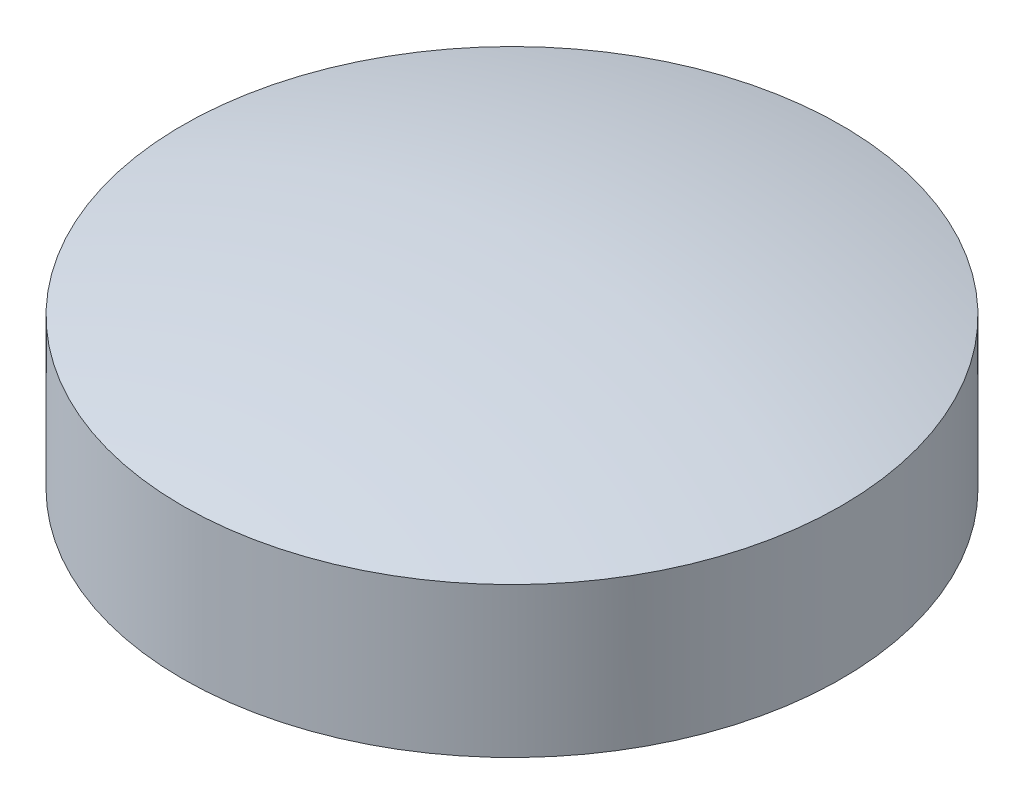
ISO-10303-21;
HEADER;
FILE_DESCRIPTION(('STEP AP214'),'2;1');
FILE_NAME('part.step','',(''),(''),'','','');
FILE_SCHEMA(('AUTOMOTIVE_DESIGN { 1 0 10303 214 1 1 1 1 }'));
ENDSEC;
DATA;
#1=APPLICATION_CONTEXT('core data for automotive mechanical design processes');
#2=APPLICATION_PROTOCOL_DEFINITION('international standard','automotive_design',2000,#1);
#3=PRODUCT_CONTEXT('',#1,'mechanical');
#4=PRODUCT('Part','Part','',(#3));
#5=PRODUCT_RELATED_PRODUCT_CATEGORY('part','',(#4));
#6=PRODUCT_DEFINITION_FORMATION('','',#4);
#7=PRODUCT_DEFINITION_CONTEXT('part definition',#1,'design');
#8=PRODUCT_DEFINITION('design','',#6,#7);
#9=PRODUCT_DEFINITION_SHAPE('','',#8);
#10=(LENGTH_UNIT() NAMED_UNIT(*) SI_UNIT(.MILLI.,.METRE.));
#11=(NAMED_UNIT(*) PLANE_ANGLE_UNIT() SI_UNIT($,.RADIAN.));
#12=(NAMED_UNIT(*) SI_UNIT($,.STERADIAN.) SOLID_ANGLE_UNIT());
#13=UNCERTAINTY_MEASURE_WITH_UNIT(LENGTH_MEASURE(1.E-05),#10,'distance_accuracy_value','');
#14=(GEOMETRIC_REPRESENTATION_CONTEXT(3) GLOBAL_UNCERTAINTY_ASSIGNED_CONTEXT((#13)) GLOBAL_UNIT_ASSIGNED_CONTEXT((#10,
#11,#12)) REPRESENTATION_CONTEXT('',''));
#15=CARTESIAN_POINT('',(0.,0.,0.));
#16=DIRECTION('',(0.,0.,1.));
#17=DIRECTION('',(1.,0.,0.));
#18=AXIS2_PLACEMENT_3D('',#15,#16,#17);
#19=CARTESIAN_POINT('',(22.,-69.1666666666663,0.));
#20=DIRECTION('',(0.,1.,0.));
#21=DIRECTION('',(1.,0.,0.));
#22=AXIS2_PLACEMENT_3D('',#19,#20,#21);
#23=SPHERICAL_SURFACE('',#22,82.1666666666663);
#24=CARTESIAN_POINT('',(22.,10.,0.));
#25=DIRECTION('',(0.,1.,0.));
#26=DIRECTION('',(0.,0.,1.));
#27=AXIS2_PLACEMENT_3D('',#24,#25,#26);
#28=CIRCLE('',#27,22.);
#29=CARTESIAN_POINT('',(22.,10.,22.));
#30=VERTEX_POINT('',#29);
#31=EDGE_CURVE('E40',#30,#30,#28,.T.);
#32=ORIENTED_EDGE('',*,*,#31,.T.);
#33=EDGE_LOOP('',(#32));
#34=FACE_BOUND('',#33,.T.);
#35=ADVANCED_FACE('F33',(#34),#23,.T.);
#36=CARTESIAN_POINT('',(22.,29.7064079951906,0.));
#37=DIRECTION('',(0.,1.,0.));
#38=DIRECTION('',(0.,0.,1.));
#39=AXIS2_PLACEMENT_3D('',#36,#37,#38);
#40=CYLINDRICAL_SURFACE('',#39,22.);
#41=DIRECTION('',(0.,-1.,0.));
#42=VECTOR('',#41,1.);
#43=CARTESIAN_POINT('',(0.051136363636364,2.5,1.49912810403716));
#44=LINE('',#43,#42);
#45=CARTESIAN_POINT('',(0.051136363636364,0.,1.49912810403716));
#46=VERTEX_POINT('',#45);
#47=CARTESIAN_POINT('',(0.0511363636363643,5.,1.49912810403716));
#48=VERTEX_POINT('',#47);
#49=EDGE_CURVE('E63',#46,#48,#44,.F.);
#50=ORIENTED_EDGE('',*,*,#49,.F.);
#51=CARTESIAN_POINT('',(22.,0.,0.));
#52=DIRECTION('',(0.,1.,0.));
#53=DIRECTION('',(0.,0.,1.));
#54=AXIS2_PLACEMENT_3D('',#51,#52,#53);
#55=CIRCLE('',#54,22.);
#56=CARTESIAN_POINT('',(0.0511363636363643,0.,-1.49912810403717));
#57=VERTEX_POINT('',#56);
#58=EDGE_CURVE('E69',#46,#57,#55,.T.);
#59=ORIENTED_EDGE('',*,*,#58,.T.);
#60=DIRECTION('',(0.,-1.,0.));
#61=VECTOR('',#60,1.);
#62=CARTESIAN_POINT('',(0.051136363636364,2.5,-1.49912810403716));
#63=LINE('',#62,#61);
#64=CARTESIAN_POINT('',(0.0511363636363643,5.,-1.49912810403716));
#65=VERTEX_POINT('',#64);
#66=EDGE_CURVE('E47',#65,#57,#63,.T.);
#67=ORIENTED_EDGE('',*,*,#66,.F.);
#68=CARTESIAN_POINT('',(22.,5.,0.));
#69=DIRECTION('',(0.,-1.,0.));
#70=DIRECTION('',(0.,0.,-1.));
#71=AXIS2_PLACEMENT_3D('',#68,#69,#70);
#72=CIRCLE('',#71,22.);
#73=EDGE_CURVE('E11',#65,#48,#72,.F.);
#74=ORIENTED_EDGE('',*,*,#73,.T.);
#75=EDGE_LOOP('',(#50,#59,#67,#74));
#76=FACE_BOUND('',#75,.T.);
#77=ORIENTED_EDGE('',*,*,#31,.F.);
#78=EDGE_LOOP('',(#77));
#79=FACE_BOUND('',#78,.T.);
#80=ADVANCED_FACE('F66',(#76,#79),#40,.T.);
#81=CARTESIAN_POINT('',(22.,0.,0.));
#82=DIRECTION('',(0.,-1.,0.));
#83=DIRECTION('',(0.,0.,-1.));
#84=AXIS2_PLACEMENT_3D('',#81,#82,#83);
#85=PLANE('',#84);
#86=CARTESIAN_POINT('',(0.,0.,0.));
#87=DIRECTION('',(0.,-1.,0.));
#88=DIRECTION('',(0.,0.,-1.));
#89=AXIS2_PLACEMENT_3D('',#86,#87,#88);
#90=CIRCLE('',#89,1.5);
#91=EDGE_CURVE('E51',#57,#46,#90,.T.);
#92=ORIENTED_EDGE('',*,*,#91,.F.);
#93=ORIENTED_EDGE('',*,*,#58,.F.);
#94=EDGE_LOOP('',(#92,#93));
#95=FACE_BOUND('',#94,.T.);
#96=ADVANCED_FACE('F78',(#95),#85,.T.);
#97=CARTESIAN_POINT('',(0.,5.,0.));
#98=DIRECTION('',(0.,-1.,0.));
#99=DIRECTION('',(0.,0.,-1.));
#100=AXIS2_PLACEMENT_3D('',#97,#98,#99);
#101=CYLINDRICAL_SURFACE('',#100,1.5);
#102=ORIENTED_EDGE('',*,*,#49,.T.);
#103=CARTESIAN_POINT('',(0.,5.,0.));
#104=DIRECTION('',(0.,-1.,0.));
#105=DIRECTION('',(0.,0.,-1.));
#106=AXIS2_PLACEMENT_3D('',#103,#104,#105);
#107=CIRCLE('',#106,1.5);
#108=EDGE_CURVE('E60',#65,#48,#107,.T.);
#109=ORIENTED_EDGE('',*,*,#108,.F.);
#110=ORIENTED_EDGE('',*,*,#66,.T.);
#111=ORIENTED_EDGE('',*,*,#91,.T.);
#112=EDGE_LOOP('',(#102,#109,#110,#111));
#113=FACE_BOUND('',#112,.T.);
#114=ADVANCED_FACE('F62',(#113),#101,.F.);
#115=CARTESIAN_POINT('',(0.,5.,0.));
#116=DIRECTION('',(0.,-1.,0.));
#117=DIRECTION('',(0.,0.,-1.));
#118=AXIS2_PLACEMENT_3D('',#115,#116,#117);
#119=PLANE('',#118);
#120=ORIENTED_EDGE('',*,*,#108,.T.);
#121=ORIENTED_EDGE('',*,*,#73,.F.);
#122=EDGE_LOOP('',(#120,#121));
#123=FACE_BOUND('',#122,.T.);
#124=ADVANCED_FACE('F59',(#123),#119,.T.);
#125=CLOSED_SHELL('',(#35,#80,#96,#114,#124));
#126=MANIFOLD_SOLID_BREP('B2',#125);
#127=ADVANCED_BREP_SHAPE_REPRESENTATION('',(#18,#126),#14);
#128=SHAPE_DEFINITION_REPRESENTATION(#9,#127);
ENDSEC;
END-ISO-10303-21;
